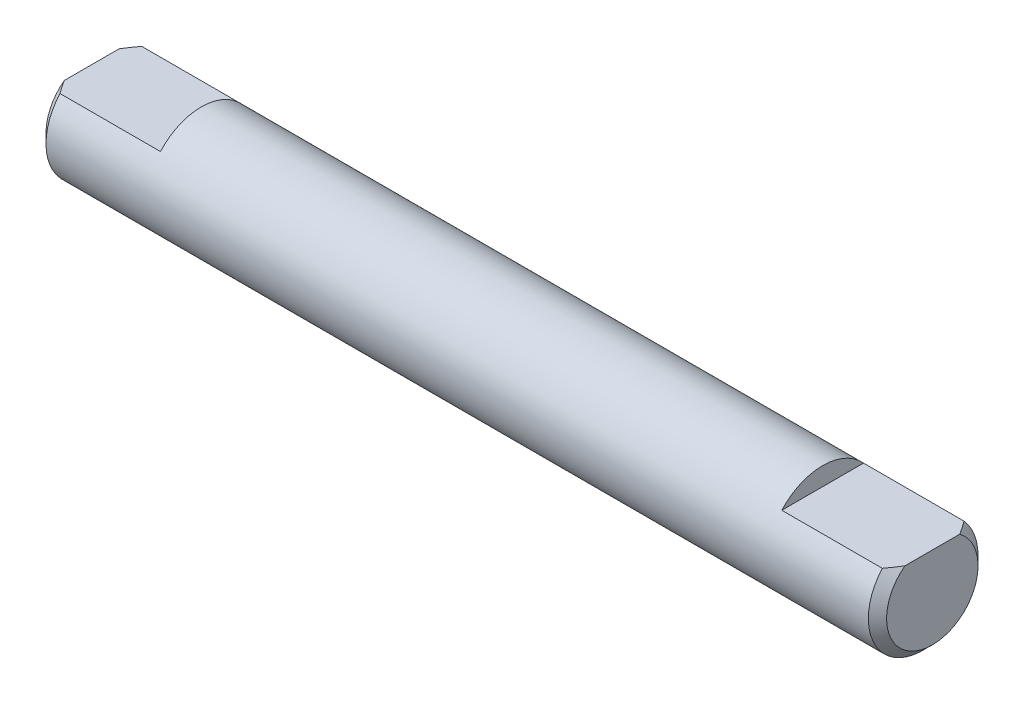
ISO-10303-21;
HEADER;
FILE_DESCRIPTION(('STEP AP214'),'2;1');
FILE_NAME('part.step','',(''),(''),'','','');
FILE_SCHEMA(('AUTOMOTIVE_DESIGN { 1 0 10303 214 1 1 1 1 }'));
ENDSEC;
DATA;
#1=APPLICATION_CONTEXT('core data for automotive mechanical design processes');
#2=APPLICATION_PROTOCOL_DEFINITION('international standard','automotive_design',2000,#1);
#3=PRODUCT_CONTEXT('',#1,'mechanical');
#4=PRODUCT('Part','Part','',(#3));
#5=PRODUCT_RELATED_PRODUCT_CATEGORY('part','',(#4));
#6=PRODUCT_DEFINITION_FORMATION('','',#4);
#7=PRODUCT_DEFINITION_CONTEXT('part definition',#1,'design');
#8=PRODUCT_DEFINITION('design','',#6,#7);
#9=PRODUCT_DEFINITION_SHAPE('','',#8);
#10=(LENGTH_UNIT() NAMED_UNIT(*) SI_UNIT(.MILLI.,.METRE.));
#11=(NAMED_UNIT(*) PLANE_ANGLE_UNIT() SI_UNIT($,.RADIAN.));
#12=(NAMED_UNIT(*) SI_UNIT($,.STERADIAN.) SOLID_ANGLE_UNIT());
#13=UNCERTAINTY_MEASURE_WITH_UNIT(LENGTH_MEASURE(1.E-05),#10,'distance_accuracy_value','');
#14=(GEOMETRIC_REPRESENTATION_CONTEXT(3) GLOBAL_UNCERTAINTY_ASSIGNED_CONTEXT((#13)) GLOBAL_UNIT_ASSIGNED_CONTEXT((#10,
#11,#12)) REPRESENTATION_CONTEXT('',''));
#15=CARTESIAN_POINT('',(0.,0.,0.));
#16=DIRECTION('',(0.,0.,1.));
#17=DIRECTION('',(1.,0.,0.));
#18=AXIS2_PLACEMENT_3D('',#15,#16,#17);
#19=CARTESIAN_POINT('',(23.,0.,0.));
#20=DIRECTION('',(-1.,0.,0.));
#21=DIRECTION('',(0.,0.,1.));
#22=AXIS2_PLACEMENT_3D('',#19,#20,#21);
#23=CYLINDRICAL_SURFACE('',#22,3.);
#24=CARTESIAN_POINT('',(22.5,0.,0.));
#25=DIRECTION('',(1.,0.,0.));
#26=DIRECTION('',(0.,0.,-1.));
#27=AXIS2_PLACEMENT_3D('',#24,#25,#26);
#28=CIRCLE('',#27,3.);
#29=CARTESIAN_POINT('',(22.5,2.,-2.23606797749979));
#30=VERTEX_POINT('',#29);
#31=CARTESIAN_POINT('',(22.5,2.,2.23606797749979));
#32=VERTEX_POINT('',#31);
#33=EDGE_CURVE('E121',#30,#32,#28,.F.);
#34=ORIENTED_EDGE('',*,*,#33,.T.);
#35=DIRECTION('',(1.,0.,0.));
#36=VECTOR('',#35,1.);
#37=CARTESIAN_POINT('',(17.,2.,2.23606797749979));
#38=LINE('',#37,#36);
#39=CARTESIAN_POINT('',(17.,2.,2.23606797749979));
#40=VERTEX_POINT('',#39);
#41=EDGE_CURVE('E116',#40,#32,#38,.T.);
#42=ORIENTED_EDGE('',*,*,#41,.F.);
#43=CARTESIAN_POINT('',(17.,0.,0.));
#44=DIRECTION('',(1.,0.,0.));
#45=DIRECTION('',(0.,0.,-1.));
#46=AXIS2_PLACEMENT_3D('',#43,#44,#45);
#47=CIRCLE('',#46,3.);
#48=CARTESIAN_POINT('',(17.,2.,-2.23606797749979));
#49=VERTEX_POINT('',#48);
#50=EDGE_CURVE('E111',#49,#40,#47,.T.);
#51=ORIENTED_EDGE('',*,*,#50,.F.);
#52=DIRECTION('',(1.,0.,0.));
#53=VECTOR('',#52,1.);
#54=CARTESIAN_POINT('',(17.,2.,-2.23606797749979));
#55=LINE('',#54,#53);
#56=EDGE_CURVE('E118',#49,#30,#55,.T.);
#57=ORIENTED_EDGE('',*,*,#56,.T.);
#58=EDGE_LOOP('',(#34,#42,#51,#57));
#59=FACE_BOUND('',#58,.T.);
#60=DIRECTION('',(-1.,0.,0.));
#61=VECTOR('',#60,1.);
#62=CARTESIAN_POINT('',(-17.,2.,-2.23606797749979));
#63=LINE('',#62,#61);
#64=CARTESIAN_POINT('',(-17.,2.,-2.23606797749979));
#65=VERTEX_POINT('',#64);
#66=CARTESIAN_POINT('',(-22.5,2.,-2.23606797749979));
#67=VERTEX_POINT('',#66);
#68=EDGE_CURVE('E55',#65,#67,#63,.T.);
#69=ORIENTED_EDGE('',*,*,#68,.F.);
#70=CARTESIAN_POINT('',(-17.,0.,0.));
#71=DIRECTION('',(1.,0.,0.));
#72=DIRECTION('',(0.,0.,-1.));
#73=AXIS2_PLACEMENT_3D('',#70,#71,#72);
#74=CIRCLE('',#73,3.);
#75=CARTESIAN_POINT('',(-17.,2.,2.23606797749979));
#76=VERTEX_POINT('',#75);
#77=EDGE_CURVE('E98',#65,#76,#74,.T.);
#78=ORIENTED_EDGE('',*,*,#77,.T.);
#79=DIRECTION('',(-1.,0.,0.));
#80=VECTOR('',#79,1.);
#81=CARTESIAN_POINT('',(-17.,2.,2.23606797749979));
#82=LINE('',#81,#80);
#83=CARTESIAN_POINT('',(-22.5,2.,2.23606797749979));
#84=VERTEX_POINT('',#83);
#85=EDGE_CURVE('E95',#76,#84,#82,.T.);
#86=ORIENTED_EDGE('',*,*,#85,.T.);
#87=CARTESIAN_POINT('',(-22.5,0.,0.));
#88=DIRECTION('',(1.,0.,0.));
#89=DIRECTION('',(0.,0.,-1.));
#90=AXIS2_PLACEMENT_3D('',#87,#88,#89);
#91=CIRCLE('',#90,3.);
#92=EDGE_CURVE('E106',#84,#67,#91,.T.);
#93=ORIENTED_EDGE('',*,*,#92,.T.);
#94=EDGE_LOOP('',(#69,#78,#86,#93));
#95=FACE_BOUND('',#94,.T.);
#96=ADVANCED_FACE('F34',(#59,#95),#23,.T.);
#97=CARTESIAN_POINT('',(-23.,0.,0.));
#98=DIRECTION('',(1.,0.,0.));
#99=DIRECTION('',(0.,0.,-1.));
#100=AXIS2_PLACEMENT_3D('',#97,#98,#99);
#101=PLANE('',#100);
#102=DIRECTION('',(0.,0.,-1.));
#103=VECTOR('',#102,1.);
#104=CARTESIAN_POINT('',(-23.,2.,2.23606797749979));
#105=LINE('',#104,#103);
#106=CARTESIAN_POINT('',(-23.,2.,1.49999999999999));
#107=VERTEX_POINT('',#106);
#108=CARTESIAN_POINT('',(-23.,2.,-1.49999999999999));
#109=VERTEX_POINT('',#108);
#110=EDGE_CURVE('E102',#107,#109,#105,.T.);
#111=ORIENTED_EDGE('',*,*,#110,.T.);
#112=CARTESIAN_POINT('',(-23.,0.,0.));
#113=DIRECTION('',(1.,0.,0.));
#114=DIRECTION('',(0.,0.,-1.));
#115=AXIS2_PLACEMENT_3D('',#112,#113,#114);
#116=CIRCLE('',#115,2.5);
#117=EDGE_CURVE('E126',#109,#107,#116,.F.);
#118=ORIENTED_EDGE('',*,*,#117,.T.);
#119=EDGE_LOOP('',(#111,#118));
#120=FACE_BOUND('',#119,.T.);
#121=ADVANCED_FACE('F149',(#120),#101,.F.);
#122=CARTESIAN_POINT('',(-22.5,0.,0.));
#123=DIRECTION('',(1.,0.,0.));
#124=DIRECTION('',(0.,0.,-1.));
#125=AXIS2_PLACEMENT_3D('',#122,#123,#124);
#126=CONICAL_SURFACE('',#125,3.,0.785398163397452);
#127=ORIENTED_EDGE('',*,*,#92,.F.);
#128=CARTESIAN_POINT('',(-20.1739562951765,2.,4.93626797749979));
#129=CARTESIAN_POINT('',(-20.3116263102323,2.,4.78768381124845));
#130=CARTESIAN_POINT('',(-20.4488688001703,2.,4.63869756596273));
#131=CARTESIAN_POINT('',(-20.7221404063521,2.,4.33955728207182));
#132=CARTESIAN_POINT('',(-20.8581692492664,2.,4.18940299398387));
#133=CARTESIAN_POINT('',(-21.1294043369861,2.,3.88672415849227));
#134=CARTESIAN_POINT('',(-21.2646007730296,2.,3.7341908006299));
#135=CARTESIAN_POINT('',(-21.5326839106298,2.,3.42713160304089));
#136=CARTESIAN_POINT('',(-21.6655708826726,2.,3.27260600039062));
#137=CARTESIAN_POINT('',(-21.9016416051834,2.,2.99210640438999));
#138=CARTESIAN_POINT('',(-22.0054251811024,2.,2.86663901089742));
#139=CARTESIAN_POINT('',(-22.2100672620052,2.,2.61328277643715));
#140=CARTESIAN_POINT('',(-22.3109250532625,2.,2.48539335700055));
#141=CARTESIAN_POINT('',(-22.5082990419047,2.,2.22650548443354));
#142=CARTESIAN_POINT('',(-22.6048202373963,2.,2.09551089088956));
#143=CARTESIAN_POINT('',(-22.7447671190917,2.,1.89566419584528));
#144=CARTESIAN_POINT('',(-22.7906025013962,2.,1.82850179908418));
#145=CARTESIAN_POINT('',(-22.8802458696183,2.,1.69284128038713));
#146=CARTESIAN_POINT('',(-22.9240540801268,2.,1.62434330762088));
#147=CARTESIAN_POINT('',(-23.0077568287426,2.,1.48797798387184));
#148=CARTESIAN_POINT('',(-23.0477316201661,2.,1.42016017631463));
#149=CARTESIAN_POINT('',(-23.124626643768,2.,1.28282423563598));
#150=CARTESIAN_POINT('',(-23.1615475696607,2.,1.21330649334523));
#151=CARTESIAN_POINT('',(-23.2314815211118,2.,1.07234023444369));
#152=CARTESIAN_POINT('',(-23.264496175163,2.,1.0008925377824));
#153=CARTESIAN_POINT('',(-23.3255401133741,2.,0.85592730514427));
#154=CARTESIAN_POINT('',(-23.3535707912893,2.,0.782410354510823));
#155=CARTESIAN_POINT('',(-23.4173281170312,2.,0.591196656014608));
#156=CARTESIAN_POINT('',(-23.44853668053,2.,0.471874440503044));
#157=CARTESIAN_POINT('',(-23.4798985537804,2.,0.290464949037767));
#158=CARTESIAN_POINT('',(-23.4877770901142,2.,0.229673626127377));
#159=CARTESIAN_POINT('',(-23.4980276880383,2.,0.107614500574353));
#160=CARTESIAN_POINT('',(-23.5004000751751,2.,0.0463467263164194));
#161=CARTESIAN_POINT('',(-23.4994876340507,2.,-0.0763197942470347));
#162=CARTESIAN_POINT('',(-23.4961865331302,2.,-0.137718411127131));
#163=CARTESIAN_POINT('',(-23.4840927327863,2.,-0.259968375583738));
#164=CARTESIAN_POINT('',(-23.4752996010043,2.,-0.320819679690591));
#165=CARTESIAN_POINT('',(-23.4526584972667,2.,-0.441758386957275));
#166=CARTESIAN_POINT('',(-23.4387947934545,2.,-0.501842803788246));
#167=CARTESIAN_POINT('',(-23.4066497947718,2.,-0.620801694696722));
#168=CARTESIAN_POINT('',(-23.3883682885415,2.,-0.679676110738205));
#169=CARTESIAN_POINT('',(-23.32353373849,2.,-0.867010178133715));
#170=CARTESIAN_POINT('',(-23.269655609127,2.,-0.992934833748156));
#171=CARTESIAN_POINT('',(-23.1498194583963,2.,-1.23892735531403));
#172=CARTESIAN_POINT('',(-23.0838370471123,2.,-1.35898276485906));
#173=CARTESIAN_POINT('',(-22.9431293700758,2.,-1.59585458502193));
#174=CARTESIAN_POINT('',(-22.8683039830242,2.,-1.71261073718885));
#175=CARTESIAN_POINT('',(-22.7133369591881,2.,-1.94233316376557));
#176=CARTESIAN_POINT('',(-22.6332002257383,2.,-2.05530279263013));
#177=CARTESIAN_POINT('',(-22.4584536139599,2.,-2.29310526083196));
#178=CARTESIAN_POINT('',(-22.3633231135208,2.,-2.4175531463146));
#179=CARTESIAN_POINT('',(-22.169770359034,2.,-2.66387185446492));
#180=CARTESIAN_POINT('',(-22.0713476398,2.,-2.78574230894003));
#181=CARTESIAN_POINT('',(-21.8720580954331,2.,-3.02764935246809));
#182=CARTESIAN_POINT('',(-21.7711891086712,2.,-3.14768415452678));
#183=CARTESIAN_POINT('',(-21.5677067244689,2.,-3.38626695152413));
#184=CARTESIAN_POINT('',(-21.4650932831408,2.,-3.50481490892545));
#185=CARTESIAN_POINT('',(-21.2645083359917,2.,-3.73393503767578));
#186=CARTESIAN_POINT('',(-21.1666110971079,2.,-3.84457235346526));
#187=CARTESIAN_POINT('',(-20.9698872405432,2.,-4.0650206650625));
#188=CARTESIAN_POINT('',(-20.8710606043089,2.,-4.17483164429524));
#189=CARTESIAN_POINT('',(-20.672861613006,2.,-4.39356418106756));
#190=CARTESIAN_POINT('',(-20.5734907230783,2.,-4.50248706778862));
#191=CARTESIAN_POINT('',(-20.3741449318645,2.,-4.71977019005837));
#192=CARTESIAN_POINT('',(-20.2741700570922,2.,-4.82813044992246));
#193=CARTESIAN_POINT('',(-20.1739562951765,2.,-4.93626797749979));
#194=B_SPLINE_CURVE_WITH_KNOTS('',3,(#128,#129,#130,#131,#132,#133,#134,#135,#136,#137,#138,
#139,#140,#141,#142,#143,#144,#145,#146,#147,#148,#149,#150,#151,#152,#153,#154,#155,#156,#157,
#158,#159,#160,#161,#162,#163,#164,#165,#166,#167,#168,#169,#170,#171,#172,#173,#174,#175,#176,
#177,#178,#179,#180,#181,#182,#183,#184,#185,#186,#187,#188,#189,#190,#191,#192,#193),
.UNSPECIFIED.,.F.,.F.,(4,2,2,2,2,2,2,2,2,2,2,2,2,2,2,2,2,2,2,2,2,2,2,2,2,2,2,2,2,2,2,2,4),(0.,
0.607683822515699,1.21550121371796,1.82695959733875,2.43834587720767,2.92679827952436,
3.41536885142092,3.90336106917609,4.14727001406463,4.39115187121073,4.62725676477006,
4.86330787673309,5.09926023157596,5.33514649886008,5.70350071953635,5.88718743593394,
6.07086329173091,6.25506684494243,6.4392849013503,6.62407942586769,6.80888279321206,
7.21864694206687,7.62924601323273,8.04504397302749,8.46046328332827,8.93031101628628,
9.40022542091196,9.87057139026386,10.3409292103109,10.7841162696073,11.2273121949651,
11.6696319276303,12.1119323824531),.UNSPECIFIED.);
#195=EDGE_CURVE('E11',#84,#107,#194,.T.);
#196=ORIENTED_EDGE('',*,*,#195,.T.);
#197=ORIENTED_EDGE('',*,*,#117,.F.);
#198=EDGE_CURVE('E39',#109,#67,#194,.T.);
#199=ORIENTED_EDGE('',*,*,#198,.T.);
#200=EDGE_LOOP('',(#127,#196,#197,#199));
#201=FACE_BOUND('',#200,.T.);
#202=ADVANCED_FACE('F147',(#201),#126,.T.);
#203=CARTESIAN_POINT('',(23.,0.,0.));
#204=DIRECTION('',(1.,0.,0.));
#205=DIRECTION('',(0.,0.,-1.));
#206=AXIS2_PLACEMENT_3D('',#203,#204,#205);
#207=PLANE('',#206);
#208=DIRECTION('',(0.,0.,-1.));
#209=VECTOR('',#208,1.);
#210=CARTESIAN_POINT('',(23.,2.,2.23606797749979));
#211=LINE('',#210,#209);
#212=CARTESIAN_POINT('',(23.,2.,1.5));
#213=VERTEX_POINT('',#212);
#214=CARTESIAN_POINT('',(23.,2.,-1.5));
#215=VERTEX_POINT('',#214);
#216=EDGE_CURVE('E63',#213,#215,#211,.T.);
#217=ORIENTED_EDGE('',*,*,#216,.F.);
#218=CARTESIAN_POINT('',(23.,0.,0.));
#219=DIRECTION('',(1.,0.,0.));
#220=DIRECTION('',(0.,0.,-1.));
#221=AXIS2_PLACEMENT_3D('',#218,#219,#220);
#222=CIRCLE('',#221,2.5);
#223=EDGE_CURVE('E129',#213,#215,#222,.T.);
#224=ORIENTED_EDGE('',*,*,#223,.T.);
#225=EDGE_LOOP('',(#217,#224));
#226=FACE_BOUND('',#225,.T.);
#227=ADVANCED_FACE('F144',(#226),#207,.T.);
#228=CARTESIAN_POINT('',(23.,0.,0.));
#229=DIRECTION('',(-1.,0.,0.));
#230=DIRECTION('',(0.,0.,1.));
#231=AXIS2_PLACEMENT_3D('',#228,#229,#230);
#232=CONICAL_SURFACE('',#231,2.5,0.785398163397445);
#233=CARTESIAN_POINT('',(20.1739562951765,2.,4.93626797749979));
#234=CARTESIAN_POINT('',(20.3116263102323,2.,4.78768381124845));
#235=CARTESIAN_POINT('',(20.4488688001702,2.,4.63869756596274));
#236=CARTESIAN_POINT('',(20.7221404063521,2.,4.33955728207182));
#237=CARTESIAN_POINT('',(20.8581692492664,2.,4.18940299398388));
#238=CARTESIAN_POINT('',(21.1294043369861,2.,3.88672415849228));
#239=CARTESIAN_POINT('',(21.2646007730296,2.,3.73419080062991));
#240=CARTESIAN_POINT('',(21.5326839106297,2.,3.4271316030409));
#241=CARTESIAN_POINT('',(21.6655708826726,2.,3.27260600039064));
#242=CARTESIAN_POINT('',(21.9016416051834,2.,2.99210640439001));
#243=CARTESIAN_POINT('',(22.0054251811024,2.,2.86663901089745));
#244=CARTESIAN_POINT('',(22.2100672620051,2.,2.61328277643719));
#245=CARTESIAN_POINT('',(22.3109250532624,2.,2.48539335700059));
#246=CARTESIAN_POINT('',(22.5082990419047,2.,2.22650548443359));
#247=CARTESIAN_POINT('',(22.6048202373962,2.,2.09551089088962));
#248=CARTESIAN_POINT('',(22.7447671190917,2.,1.89566419584535));
#249=CARTESIAN_POINT('',(22.7906025013961,2.,1.82850179908424));
#250=CARTESIAN_POINT('',(22.8802458696183,2.,1.6928412803872));
#251=CARTESIAN_POINT('',(22.9240540801268,2.,1.62434330762096));
#252=CARTESIAN_POINT('',(23.0077568287426,2.,1.48797798387191));
#253=CARTESIAN_POINT('',(23.0477316201661,2.,1.42016017631471));
#254=CARTESIAN_POINT('',(23.1246266437679,2.,1.28282423563605));
#255=CARTESIAN_POINT('',(23.1615475696606,2.,1.2133064933453));
#256=CARTESIAN_POINT('',(23.2314815211118,2.,1.07234023444376));
#257=CARTESIAN_POINT('',(23.2644961751629,2.,1.00089253778247));
#258=CARTESIAN_POINT('',(23.3255401133741,2.,0.855927305144334));
#259=CARTESIAN_POINT('',(23.3535707912893,2.,0.782410354510885));
#260=CARTESIAN_POINT('',(23.4173281170312,2.,0.591196656014668));
#261=CARTESIAN_POINT('',(23.44853668053,2.,0.471874440503104));
#262=CARTESIAN_POINT('',(23.4798985537804,2.,0.290464949037828));
#263=CARTESIAN_POINT('',(23.4877770901142,2.,0.229673626127439));
#264=CARTESIAN_POINT('',(23.4980276880384,2.,0.107614500574415));
#265=CARTESIAN_POINT('',(23.5004000751751,2.,0.046346726316481));
#266=CARTESIAN_POINT('',(23.4994876340507,2.,-0.0763197942469739));
#267=CARTESIAN_POINT('',(23.4961865331302,2.,-0.13771841112707));
#268=CARTESIAN_POINT('',(23.4840927327863,2.,-0.259968375583678));
#269=CARTESIAN_POINT('',(23.4752996010044,2.,-0.320819679690532));
#270=CARTESIAN_POINT('',(23.4526584972667,2.,-0.441758386957216));
#271=CARTESIAN_POINT('',(23.4387947934545,2.,-0.501842803788188));
#272=CARTESIAN_POINT('',(23.4066497947718,2.,-0.620801694696665));
#273=CARTESIAN_POINT('',(23.3883682885415,2.,-0.679676110738149));
#274=CARTESIAN_POINT('',(23.32353373849,2.,-0.867010178133648));
#275=CARTESIAN_POINT('',(23.2696556091271,2.,-0.992934833748078));
#276=CARTESIAN_POINT('',(23.1498194583964,2.,-1.23892735531393));
#277=CARTESIAN_POINT('',(23.0838370471123,2.,-1.35898276485895));
#278=CARTESIAN_POINT('',(22.9431293700759,2.,-1.5958545850218));
#279=CARTESIAN_POINT('',(22.8683039830243,2.,-1.71261073718871));
#280=CARTESIAN_POINT('',(22.7133369591882,2.,-1.94233316376541));
#281=CARTESIAN_POINT('',(22.6332002257384,2.,-2.05530279262996));
#282=CARTESIAN_POINT('',(22.45845361396,2.,-2.2931052608318));
#283=CARTESIAN_POINT('',(22.363323113521,2.,-2.41755314631445));
#284=CARTESIAN_POINT('',(22.1697703590341,2.,-2.66387185446479));
#285=CARTESIAN_POINT('',(22.0713476398001,2.,-2.78574230893991));
#286=CARTESIAN_POINT('',(21.8720580954332,2.,-3.02764935246798));
#287=CARTESIAN_POINT('',(21.7711891086713,2.,-3.14768415452668));
#288=CARTESIAN_POINT('',(21.5677067244689,2.,-3.38626695152405));
#289=CARTESIAN_POINT('',(21.4650932831408,2.,-3.50481490892537));
#290=CARTESIAN_POINT('',(21.2645083359917,2.,-3.73393503767572));
#291=CARTESIAN_POINT('',(21.1666110971079,2.,-3.84457235346521));
#292=CARTESIAN_POINT('',(20.9698872405432,2.,-4.06502066506245));
#293=CARTESIAN_POINT('',(20.8710606043089,2.,-4.1748316442952));
#294=CARTESIAN_POINT('',(20.672861613006,2.,-4.39356418106754));
#295=CARTESIAN_POINT('',(20.5734907230783,2.,-4.5024870677886));
#296=CARTESIAN_POINT('',(20.3741449318645,2.,-4.71977019005836));
#297=CARTESIAN_POINT('',(20.2741700570922,2.,-4.82813044992245));
#298=CARTESIAN_POINT('',(20.1739562951765,2.,-4.93626797749979));
#299=B_SPLINE_CURVE_WITH_KNOTS('',3,(#233,#234,#235,#236,#237,#238,#239,#240,#241,#242,#243,
#244,#245,#246,#247,#248,#249,#250,#251,#252,#253,#254,#255,#256,#257,#258,#259,#260,#261,#262,
#263,#264,#265,#266,#267,#268,#269,#270,#271,#272,#273,#274,#275,#276,#277,#278,#279,#280,#281,
#282,#283,#284,#285,#286,#287,#288,#289,#290,#291,#292,#293,#294,#295,#296,#297,#298),
.UNSPECIFIED.,.F.,.F.,(4,2,2,2,2,2,2,2,2,2,2,2,2,2,2,2,2,2,2,2,2,2,2,2,2,2,2,2,2,2,2,2,4),(0.,
0.607683822515695,1.21550121371795,1.82695959733874,2.43834587720766,2.92679827952434,
3.41536885142089,3.90336106917604,4.14727001406458,4.39115187121067,4.62725676477,
4.86330787673303,5.09926023157592,5.33514649886005,5.70350071953631,5.88718743593391,
6.07086329173088,6.2550668449424,6.43928490135027,6.62407942586766,6.80888279321203,
7.2186469420668,7.62924601323263,8.04504397302735,8.46046328332809,8.93031101628614,
9.40022542091185,9.87057139026379,10.3409292103109,10.7841162696073,11.2273121949651,
11.6696319276303,12.1119323824532),.UNSPECIFIED.);
#300=EDGE_CURVE('E137',#32,#213,#299,.T.);
#301=ORIENTED_EDGE('',*,*,#300,.F.);
#302=ORIENTED_EDGE('',*,*,#33,.F.);
#303=EDGE_CURVE('E131',#215,#30,#299,.T.);
#304=ORIENTED_EDGE('',*,*,#303,.F.);
#305=ORIENTED_EDGE('',*,*,#223,.F.);
#306=EDGE_LOOP('',(#301,#302,#304,#305));
#307=FACE_BOUND('',#306,.T.);
#308=ADVANCED_FACE('F36',(#307),#232,.T.);
#309=CARTESIAN_POINT('',(17.,2.,2.23606797749979));
#310=DIRECTION('',(0.,-1.,0.));
#311=DIRECTION('',(0.,0.,-1.));
#312=AXIS2_PLACEMENT_3D('',#309,#310,#311);
#313=PLANE('',#312);
#314=ORIENTED_EDGE('',*,*,#300,.T.);
#315=ORIENTED_EDGE('',*,*,#216,.T.);
#316=ORIENTED_EDGE('',*,*,#303,.T.);
#317=ORIENTED_EDGE('',*,*,#56,.F.);
#318=DIRECTION('',(0.,0.,-1.));
#319=VECTOR('',#318,1.);
#320=CARTESIAN_POINT('',(17.,2.,2.23606797749979));
#321=LINE('',#320,#319);
#322=EDGE_CURVE('E113',#40,#49,#321,.T.);
#323=ORIENTED_EDGE('',*,*,#322,.F.);
#324=ORIENTED_EDGE('',*,*,#41,.T.);
#325=EDGE_LOOP('',(#314,#315,#316,#317,#323,#324));
#326=FACE_BOUND('',#325,.T.);
#327=ADVANCED_FACE('F138',(#326),#313,.F.);
#328=CARTESIAN_POINT('',(17.,0.,0.));
#329=DIRECTION('',(1.,0.,0.));
#330=DIRECTION('',(0.,0.,-1.));
#331=AXIS2_PLACEMENT_3D('',#328,#329,#330);
#332=PLANE('',#331);
#333=ORIENTED_EDGE('',*,*,#50,.T.);
#334=ORIENTED_EDGE('',*,*,#322,.T.);
#335=EDGE_LOOP('',(#333,#334));
#336=FACE_BOUND('',#335,.T.);
#337=ADVANCED_FACE('F143',(#336),#332,.T.);
#338=CARTESIAN_POINT('',(-17.,2.,2.23606797749979));
#339=DIRECTION('',(0.,1.,0.));
#340=DIRECTION('',(0.,0.,1.));
#341=AXIS2_PLACEMENT_3D('',#338,#339,#340);
#342=PLANE('',#341);
#343=ORIENTED_EDGE('',*,*,#85,.F.);
#344=DIRECTION('',(0.,0.,-1.));
#345=VECTOR('',#344,1.);
#346=CARTESIAN_POINT('',(-17.,2.,2.23606797749979));
#347=LINE('',#346,#345);
#348=EDGE_CURVE('E91',#76,#65,#347,.T.);
#349=ORIENTED_EDGE('',*,*,#348,.T.);
#350=ORIENTED_EDGE('',*,*,#68,.T.);
#351=ORIENTED_EDGE('',*,*,#198,.F.);
#352=ORIENTED_EDGE('',*,*,#110,.F.);
#353=ORIENTED_EDGE('',*,*,#195,.F.);
#354=EDGE_LOOP('',(#343,#349,#350,#351,#352,#353));
#355=FACE_BOUND('',#354,.T.);
#356=ADVANCED_FACE('F93',(#355),#342,.T.);
#357=CARTESIAN_POINT('',(-17.,0.,0.));
#358=DIRECTION('',(-1.,0.,0.));
#359=DIRECTION('',(0.,0.,-1.));
#360=AXIS2_PLACEMENT_3D('',#357,#358,#359);
#361=PLANE('',#360);
#362=ORIENTED_EDGE('',*,*,#77,.F.);
#363=ORIENTED_EDGE('',*,*,#348,.F.);
#364=EDGE_LOOP('',(#362,#363));
#365=FACE_BOUND('',#364,.T.);
#366=ADVANCED_FACE('F100',(#365),#361,.T.);
#367=CLOSED_SHELL('',(#96,#121,#202,#227,#308,#327,#337,#356,#366));
#368=MANIFOLD_SOLID_BREP('B2',#367);
#369=ADVANCED_BREP_SHAPE_REPRESENTATION('',(#18,#368),#14);
#370=SHAPE_DEFINITION_REPRESENTATION(#9,#369);
ENDSEC;
END-ISO-10303-21;
